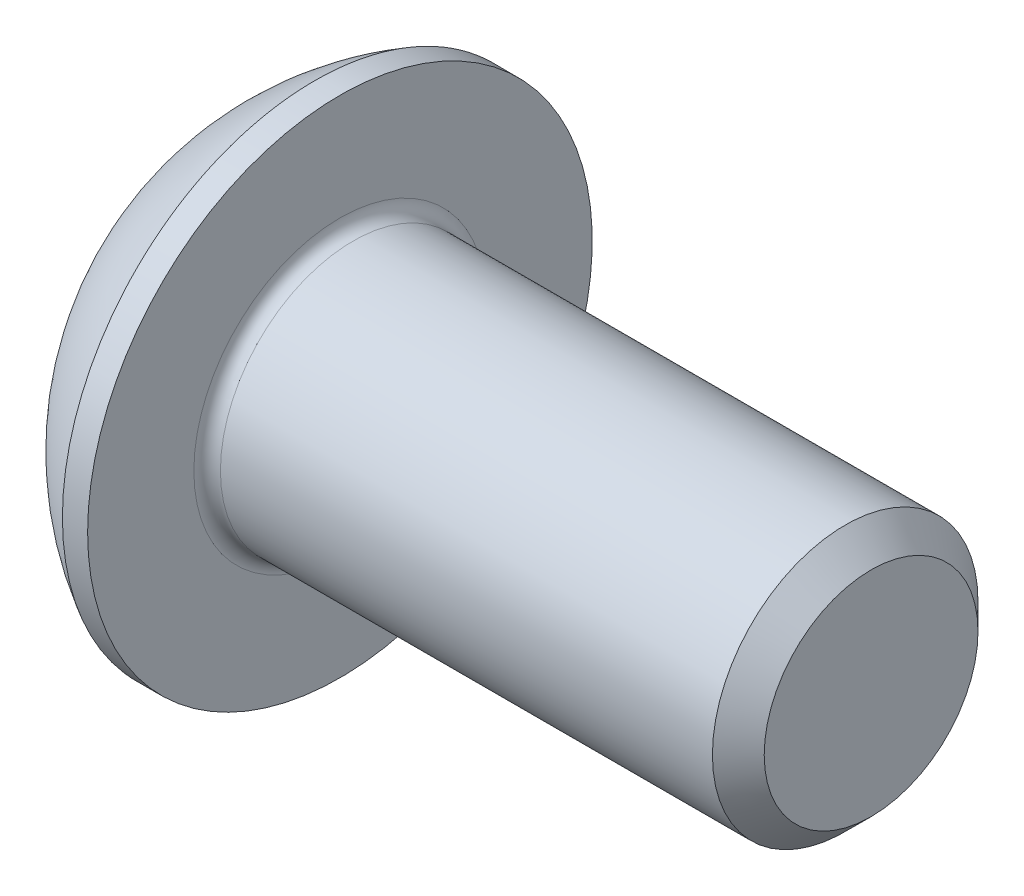
ISO-10303-21;
HEADER;
FILE_DESCRIPTION(('STEP AP214'),'2;1');
FILE_NAME('part.step','',(''),(''),'','','');
FILE_SCHEMA(('AUTOMOTIVE_DESIGN { 1 0 10303 214 1 1 1 1 }'));
ENDSEC;
DATA;
#1=APPLICATION_CONTEXT('core data for automotive mechanical design processes');
#2=APPLICATION_PROTOCOL_DEFINITION('international standard','automotive_design',2000,#1);
#3=PRODUCT_CONTEXT('',#1,'mechanical');
#4=PRODUCT('Part','Part','',(#3));
#5=PRODUCT_RELATED_PRODUCT_CATEGORY('part','',(#4));
#6=PRODUCT_DEFINITION_FORMATION('','',#4);
#7=PRODUCT_DEFINITION_CONTEXT('part definition',#1,'design');
#8=PRODUCT_DEFINITION('design','',#6,#7);
#9=PRODUCT_DEFINITION_SHAPE('','',#8);
#10=(LENGTH_UNIT() NAMED_UNIT(*) SI_UNIT(.MILLI.,.METRE.));
#11=(NAMED_UNIT(*) PLANE_ANGLE_UNIT() SI_UNIT($,.RADIAN.));
#12=(NAMED_UNIT(*) SI_UNIT($,.STERADIAN.) SOLID_ANGLE_UNIT());
#13=UNCERTAINTY_MEASURE_WITH_UNIT(LENGTH_MEASURE(1.E-05),#10,'distance_accuracy_value','');
#14=(GEOMETRIC_REPRESENTATION_CONTEXT(3) GLOBAL_UNCERTAINTY_ASSIGNED_CONTEXT((#13)) GLOBAL_UNIT_ASSIGNED_CONTEXT((#10,
#11,#12)) REPRESENTATION_CONTEXT('',''));
#15=CARTESIAN_POINT('',(0.,0.,0.));
#16=DIRECTION('',(0.,0.,1.));
#17=DIRECTION('',(1.,0.,0.));
#18=AXIS2_PLACEMENT_3D('',#15,#16,#17);
#19=CARTESIAN_POINT('',(1.29999999999997,0.,0.));
#20=DIRECTION('',(-1.,0.,0.));
#21=DIRECTION('',(0.,0.,1.));
#22=AXIS2_PLACEMENT_3D('',#19,#20,#21);
#23=CONICAL_SURFACE('',#22,1.24999999999997,1.04719755119663);
#24=CARTESIAN_POINT('',(2.02168783648693,0.,0.));
#25=VERTEX_POINT('',#24);
#26=VERTEX_LOOP('',#25);
#27=FACE_BOUND('',#26,.T.);
#28=CARTESIAN_POINT('',(1.29999999999997,0.,0.));
#29=DIRECTION('',(-1.,0.,0.));
#30=DIRECTION('',(0.,0.,1.));
#31=AXIS2_PLACEMENT_3D('',#28,#29,#30);
#32=CIRCLE('',#31,1.24999999999997);
#33=CARTESIAN_POINT('',(1.29999999999998,-1.08253175473054,0.624999999999992));
#34=VERTEX_POINT('',#33);
#35=CARTESIAN_POINT('',(1.29999999999998,0.,1.24999999999999));
#36=VERTEX_POINT('',#35);
#37=EDGE_CURVE('E97',#34,#36,#32,.T.);
#38=ORIENTED_EDGE('',*,*,#37,.T.);
#39=CARTESIAN_POINT('',(1.29999999999997,0.,0.));
#40=DIRECTION('',(-1.,0.,0.));
#41=DIRECTION('',(0.,0.,1.));
#42=AXIS2_PLACEMENT_3D('',#39,#40,#41);
#43=CIRCLE('',#42,1.24999999999997);
#44=CARTESIAN_POINT('',(1.29999999999998,1.08253175473054,0.624999999999992));
#45=VERTEX_POINT('',#44);
#46=EDGE_CURVE('E158',#36,#45,#43,.T.);
#47=ORIENTED_EDGE('',*,*,#46,.T.);
#48=CARTESIAN_POINT('',(1.29999999999997,0.,0.));
#49=DIRECTION('',(-1.,0.,0.));
#50=DIRECTION('',(0.,0.,1.));
#51=AXIS2_PLACEMENT_3D('',#48,#49,#50);
#52=CIRCLE('',#51,1.24999999999997);
#53=CARTESIAN_POINT('',(1.29999999999998,1.08253175473054,-0.624999999999994));
#54=VERTEX_POINT('',#53);
#55=EDGE_CURVE('E355',#45,#54,#52,.T.);
#56=ORIENTED_EDGE('',*,*,#55,.T.);
#57=CARTESIAN_POINT('',(1.29999999999997,0.,0.));
#58=DIRECTION('',(-1.,0.,0.));
#59=DIRECTION('',(0.,0.,1.));
#60=AXIS2_PLACEMENT_3D('',#57,#58,#59);
#61=CIRCLE('',#60,1.24999999999997);
#62=CARTESIAN_POINT('',(1.29999999999998,0.,-1.24999999999999));
#63=VERTEX_POINT('',#62);
#64=EDGE_CURVE('E356',#54,#63,#61,.T.);
#65=ORIENTED_EDGE('',*,*,#64,.T.);
#66=CARTESIAN_POINT('',(1.29999999999997,0.,0.));
#67=DIRECTION('',(-1.,0.,0.));
#68=DIRECTION('',(0.,0.,1.));
#69=AXIS2_PLACEMENT_3D('',#66,#67,#68);
#70=CIRCLE('',#69,1.24999999999997);
#71=CARTESIAN_POINT('',(1.29999999999998,-1.08253175473054,-0.624999999999993));
#72=VERTEX_POINT('',#71);
#73=EDGE_CURVE('E100',#63,#72,#70,.T.);
#74=ORIENTED_EDGE('',*,*,#73,.T.);
#75=CARTESIAN_POINT('',(1.29999999999997,0.,0.));
#76=DIRECTION('',(-1.,0.,0.));
#77=DIRECTION('',(0.,0.,1.));
#78=AXIS2_PLACEMENT_3D('',#75,#76,#77);
#79=CIRCLE('',#78,1.24999999999997);
#80=EDGE_CURVE('E95',#72,#34,#79,.T.);
#81=ORIENTED_EDGE('',*,*,#80,.T.);
#82=EDGE_LOOP('',(#38,#47,#56,#65,#74,#81));
#83=FACE_BOUND('',#82,.T.);
#84=ADVANCED_FACE('F16',(#27,#83),#23,.F.);
#85=CARTESIAN_POINT('',(1.3,-2.16506350946109,-1.25));
#86=DIRECTION('',(1.,0.,0.));
#87=DIRECTION('',(0.,0.,-1.));
#88=AXIS2_PLACEMENT_3D('',#85,#86,#87);
#89=PLANE('',#88);
#90=DIRECTION('',(0.,0.499999999999999,0.866025403784439));
#91=VECTOR('',#90,1.);
#92=CARTESIAN_POINT('',(1.3,-1.44337567297406,0.));
#93=LINE('',#92,#91);
#94=CARTESIAN_POINT('',(1.3,-0.721687836487032,1.25));
#95=VERTEX_POINT('',#94);
#96=EDGE_CURVE('E109',#95,#34,#93,.F.);
#97=ORIENTED_EDGE('',*,*,#96,.F.);
#98=DIRECTION('',(0.,1.,0.));
#99=VECTOR('',#98,1.);
#100=CARTESIAN_POINT('',(1.3,-0.721687836487032,1.25));
#101=LINE('',#100,#99);
#102=EDGE_CURVE('E111',#36,#95,#101,.F.);
#103=ORIENTED_EDGE('',*,*,#102,.F.);
#104=ORIENTED_EDGE('',*,*,#37,.F.);
#105=EDGE_LOOP('',(#97,#103,#104));
#106=FACE_BOUND('',#105,.T.);
#107=ADVANCED_FACE('F107',(#106),#89,.F.);
#108=CARTESIAN_POINT('',(1.3,-2.16506350946109,-1.25));
#109=DIRECTION('',(1.,0.,0.));
#110=DIRECTION('',(0.,0.,-1.));
#111=AXIS2_PLACEMENT_3D('',#108,#109,#110);
#112=PLANE('',#111);
#113=DIRECTION('',(0.,-0.499999999999999,0.866025403784439));
#114=VECTOR('',#113,1.);
#115=CARTESIAN_POINT('',(1.3,-0.721687836487033,-1.25));
#116=LINE('',#115,#114);
#117=CARTESIAN_POINT('',(1.3,-1.44337567297406,0.));
#118=VERTEX_POINT('',#117);
#119=EDGE_CURVE('E118',#118,#72,#116,.F.);
#120=ORIENTED_EDGE('',*,*,#119,.F.);
#121=DIRECTION('',(0.,0.499999999999999,0.866025403784439));
#122=VECTOR('',#121,1.);
#123=CARTESIAN_POINT('',(1.3,-1.44337567297406,0.));
#124=LINE('',#123,#122);
#125=EDGE_CURVE('E115',#34,#118,#124,.F.);
#126=ORIENTED_EDGE('',*,*,#125,.F.);
#127=ORIENTED_EDGE('',*,*,#80,.F.);
#128=EDGE_LOOP('',(#120,#126,#127));
#129=FACE_BOUND('',#128,.T.);
#130=ADVANCED_FACE('F116',(#129),#112,.F.);
#131=CARTESIAN_POINT('',(1.3,-2.16506350946109,-1.25));
#132=DIRECTION('',(1.,0.,0.));
#133=DIRECTION('',(0.,0.,-1.));
#134=AXIS2_PLACEMENT_3D('',#131,#132,#133);
#135=PLANE('',#134);
#136=DIRECTION('',(0.,1.,0.));
#137=VECTOR('',#136,1.);
#138=CARTESIAN_POINT('',(1.3,0.721687836487034,-1.25));
#139=LINE('',#138,#137);
#140=CARTESIAN_POINT('',(1.3,-0.721687836487033,-1.25));
#141=VERTEX_POINT('',#140);
#142=EDGE_CURVE('E324',#141,#63,#139,.T.);
#143=ORIENTED_EDGE('',*,*,#142,.F.);
#144=DIRECTION('',(0.,-0.499999999999999,0.866025403784439));
#145=VECTOR('',#144,1.);
#146=CARTESIAN_POINT('',(1.3,-0.721687836487033,-1.25));
#147=LINE('',#146,#145);
#148=EDGE_CURVE('E336',#72,#141,#147,.F.);
#149=ORIENTED_EDGE('',*,*,#148,.F.);
#150=ORIENTED_EDGE('',*,*,#73,.F.);
#151=EDGE_LOOP('',(#143,#149,#150));
#152=FACE_BOUND('',#151,.T.);
#153=ADVANCED_FACE('F202',(#152),#135,.F.);
#154=CARTESIAN_POINT('',(1.3,-2.16506350946109,-1.25));
#155=DIRECTION('',(1.,0.,0.));
#156=DIRECTION('',(0.,0.,-1.));
#157=AXIS2_PLACEMENT_3D('',#154,#155,#156);
#158=PLANE('',#157);
#159=DIRECTION('',(0.,-0.5,-0.866025403784439));
#160=VECTOR('',#159,1.);
#161=CARTESIAN_POINT('',(1.3,1.44337567297407,0.));
#162=LINE('',#161,#160);
#163=CARTESIAN_POINT('',(1.3,0.721687836487034,-1.25));
#164=VERTEX_POINT('',#163);
#165=EDGE_CURVE('E309',#164,#54,#162,.F.);
#166=ORIENTED_EDGE('',*,*,#165,.F.);
#167=DIRECTION('',(0.,1.,0.));
#168=VECTOR('',#167,1.);
#169=CARTESIAN_POINT('',(1.3,0.721687836487034,-1.25));
#170=LINE('',#169,#168);
#171=EDGE_CURVE('E321',#63,#164,#170,.T.);
#172=ORIENTED_EDGE('',*,*,#171,.F.);
#173=ORIENTED_EDGE('',*,*,#64,.F.);
#174=EDGE_LOOP('',(#166,#172,#173));
#175=FACE_BOUND('',#174,.T.);
#176=ADVANCED_FACE('F198',(#175),#158,.F.);
#177=CARTESIAN_POINT('',(1.3,-2.16506350946109,-1.25));
#178=DIRECTION('',(1.,0.,0.));
#179=DIRECTION('',(0.,0.,-1.));
#180=AXIS2_PLACEMENT_3D('',#177,#178,#179);
#181=PLANE('',#180);
#182=DIRECTION('',(0.,0.499999999999999,-0.866025403784439));
#183=VECTOR('',#182,1.);
#184=CARTESIAN_POINT('',(1.3,0.721687836487034,1.25));
#185=LINE('',#184,#183);
#186=CARTESIAN_POINT('',(1.3,1.44337567297407,0.));
#187=VERTEX_POINT('',#186);
#188=EDGE_CURVE('E287',#187,#45,#185,.F.);
#189=ORIENTED_EDGE('',*,*,#188,.F.);
#190=DIRECTION('',(0.,-0.5,-0.866025403784439));
#191=VECTOR('',#190,1.);
#192=CARTESIAN_POINT('',(1.3,1.44337567297407,0.));
#193=LINE('',#192,#191);
#194=EDGE_CURVE('E306',#54,#187,#193,.F.);
#195=ORIENTED_EDGE('',*,*,#194,.F.);
#196=ORIENTED_EDGE('',*,*,#55,.F.);
#197=EDGE_LOOP('',(#189,#195,#196));
#198=FACE_BOUND('',#197,.T.);
#199=ADVANCED_FACE('F194',(#198),#181,.F.);
#200=CARTESIAN_POINT('',(1.3,-2.16506350946109,-1.25));
#201=DIRECTION('',(1.,0.,0.));
#202=DIRECTION('',(0.,0.,-1.));
#203=AXIS2_PLACEMENT_3D('',#200,#201,#202);
#204=PLANE('',#203);
#205=DIRECTION('',(0.,1.,0.));
#206=VECTOR('',#205,1.);
#207=CARTESIAN_POINT('',(1.3,-0.721687836487032,1.25));
#208=LINE('',#207,#206);
#209=CARTESIAN_POINT('',(1.3,0.721687836487034,1.25));
#210=VERTEX_POINT('',#209);
#211=EDGE_CURVE('E127',#210,#36,#208,.F.);
#212=ORIENTED_EDGE('',*,*,#211,.F.);
#213=DIRECTION('',(0.,0.499999999999999,-0.866025403784439));
#214=VECTOR('',#213,1.);
#215=CARTESIAN_POINT('',(1.3,0.721687836487034,1.25));
#216=LINE('',#215,#214);
#217=EDGE_CURVE('E290',#45,#210,#216,.F.);
#218=ORIENTED_EDGE('',*,*,#217,.F.);
#219=ORIENTED_EDGE('',*,*,#46,.F.);
#220=EDGE_LOOP('',(#212,#218,#219));
#221=FACE_BOUND('',#220,.T.);
#222=ADVANCED_FACE('F190',(#221),#204,.F.);
#223=CARTESIAN_POINT('',(1.3,-0.721687836487032,1.25));
#224=DIRECTION('',(0.,0.,-1.));
#225=DIRECTION('',(0.,1.,0.));
#226=AXIS2_PLACEMENT_3D('',#223,#224,#225);
#227=PLANE('',#226);
#228=DIRECTION('',(0.,1.,0.));
#229=VECTOR('',#228,1.);
#230=CARTESIAN_POINT('',(0.,0.,1.25));
#231=LINE('',#230,#229);
#232=CARTESIAN_POINT('',(0.,0.721687836487034,1.25));
#233=VERTEX_POINT('',#232);
#234=CARTESIAN_POINT('',(0.,-0.721687836487032,1.25));
#235=VERTEX_POINT('',#234);
#236=EDGE_CURVE('E283',#233,#235,#231,.F.);
#237=ORIENTED_EDGE('',*,*,#236,.F.);
#238=DIRECTION('',(1.,0.,0.));
#239=VECTOR('',#238,1.);
#240=CARTESIAN_POINT('',(1.3,0.721687836487034,1.25));
#241=LINE('',#240,#239);
#242=EDGE_CURVE('E296',#210,#233,#241,.F.);
#243=ORIENTED_EDGE('',*,*,#242,.F.);
#244=ORIENTED_EDGE('',*,*,#211,.T.);
#245=ORIENTED_EDGE('',*,*,#102,.T.);
#246=DIRECTION('',(1.,0.,0.));
#247=VECTOR('',#246,1.);
#248=CARTESIAN_POINT('',(1.3,-0.721687836487032,1.25));
#249=LINE('',#248,#247);
#250=EDGE_CURVE('E121',#235,#95,#249,.T.);
#251=ORIENTED_EDGE('',*,*,#250,.F.);
#252=EDGE_LOOP('',(#237,#243,#244,#245,#251));
#253=FACE_BOUND('',#252,.T.);
#254=ADVANCED_FACE('F187',(#253),#227,.T.);
#255=CARTESIAN_POINT('',(1.3,-1.44337567297406,0.));
#256=DIRECTION('',(0.,0.866025403784439,-0.499999999999999));
#257=DIRECTION('',(0.,0.499999999999999,0.866025403784439));
#258=AXIS2_PLACEMENT_3D('',#255,#256,#257);
#259=PLANE('',#258);
#260=DIRECTION('',(0.,-0.499999999999999,-0.866025403784439));
#261=VECTOR('',#260,1.);
#262=CARTESIAN_POINT('',(0.,-0.721687836487032,1.25));
#263=LINE('',#262,#261);
#264=CARTESIAN_POINT('',(0.,-1.44337567297406,0.));
#265=VERTEX_POINT('',#264);
#266=EDGE_CURVE('E280',#235,#265,#263,.T.);
#267=ORIENTED_EDGE('',*,*,#266,.F.);
#268=ORIENTED_EDGE('',*,*,#250,.T.);
#269=ORIENTED_EDGE('',*,*,#96,.T.);
#270=ORIENTED_EDGE('',*,*,#125,.T.);
#271=DIRECTION('',(1.,0.,0.));
#272=VECTOR('',#271,1.);
#273=CARTESIAN_POINT('',(1.3,-1.44337567297406,0.));
#274=LINE('',#273,#272);
#275=EDGE_CURVE('E333',#265,#118,#274,.T.);
#276=ORIENTED_EDGE('',*,*,#275,.F.);
#277=EDGE_LOOP('',(#267,#268,#269,#270,#276));
#278=FACE_BOUND('',#277,.T.);
#279=ADVANCED_FACE('F125',(#278),#259,.T.);
#280=CARTESIAN_POINT('',(1.3,-0.721687836487033,-1.25));
#281=DIRECTION('',(0.,0.866025403784439,0.499999999999999));
#282=DIRECTION('',(0.,-0.499999999999999,0.866025403784439));
#283=AXIS2_PLACEMENT_3D('',#280,#281,#282);
#284=PLANE('',#283);
#285=DIRECTION('',(0.,0.499999999999999,-0.866025403784439));
#286=VECTOR('',#285,1.);
#287=CARTESIAN_POINT('',(0.,-1.44337567297406,0.));
#288=LINE('',#287,#286);
#289=CARTESIAN_POINT('',(0.,-0.721687836487033,-1.25));
#290=VERTEX_POINT('',#289);
#291=EDGE_CURVE('E277',#265,#290,#288,.T.);
#292=ORIENTED_EDGE('',*,*,#291,.F.);
#293=ORIENTED_EDGE('',*,*,#275,.T.);
#294=ORIENTED_EDGE('',*,*,#119,.T.);
#295=ORIENTED_EDGE('',*,*,#148,.T.);
#296=DIRECTION('',(1.,0.,0.));
#297=VECTOR('',#296,1.);
#298=CARTESIAN_POINT('',(1.3,-0.721687836487033,-1.25));
#299=LINE('',#298,#297);
#300=EDGE_CURVE('E318',#290,#141,#299,.T.);
#301=ORIENTED_EDGE('',*,*,#300,.F.);
#302=EDGE_LOOP('',(#292,#293,#294,#295,#301));
#303=FACE_BOUND('',#302,.T.);
#304=ADVANCED_FACE('F180',(#303),#284,.T.);
#305=CARTESIAN_POINT('',(1.3,0.721687836487034,-1.25));
#306=DIRECTION('',(0.,0.,1.));
#307=DIRECTION('',(1.,0.,0.));
#308=AXIS2_PLACEMENT_3D('',#305,#306,#307);
#309=PLANE('',#308);
#310=DIRECTION('',(0.,1.,0.));
#311=VECTOR('',#310,1.);
#312=CARTESIAN_POINT('',(0.,0.,-1.25));
#313=LINE('',#312,#311);
#314=CARTESIAN_POINT('',(0.,0.721687836487034,-1.25));
#315=VERTEX_POINT('',#314);
#316=EDGE_CURVE('E274',#290,#315,#313,.T.);
#317=ORIENTED_EDGE('',*,*,#316,.F.);
#318=ORIENTED_EDGE('',*,*,#300,.T.);
#319=ORIENTED_EDGE('',*,*,#142,.T.);
#320=ORIENTED_EDGE('',*,*,#171,.T.);
#321=DIRECTION('',(1.,0.,0.));
#322=VECTOR('',#321,1.);
#323=CARTESIAN_POINT('',(1.3,0.721687836487035,-1.25));
#324=LINE('',#323,#322);
#325=EDGE_CURVE('E291',#315,#164,#324,.T.);
#326=ORIENTED_EDGE('',*,*,#325,.F.);
#327=EDGE_LOOP('',(#317,#318,#319,#320,#326));
#328=FACE_BOUND('',#327,.T.);
#329=ADVANCED_FACE('F176',(#328),#309,.T.);
#330=CARTESIAN_POINT('',(1.3,1.44337567297407,0.));
#331=DIRECTION('',(0.,-0.866025403784439,0.5));
#332=DIRECTION('',(0.,-0.5,-0.866025403784439));
#333=AXIS2_PLACEMENT_3D('',#330,#331,#332);
#334=PLANE('',#333);
#335=DIRECTION('',(0.,0.5,0.866025403784439));
#336=VECTOR('',#335,1.);
#337=CARTESIAN_POINT('',(0.,0.721687836487034,-1.25));
#338=LINE('',#337,#336);
#339=CARTESIAN_POINT('',(0.,1.44337567297407,0.));
#340=VERTEX_POINT('',#339);
#341=EDGE_CURVE('E271',#315,#340,#338,.T.);
#342=ORIENTED_EDGE('',*,*,#341,.F.);
#343=ORIENTED_EDGE('',*,*,#325,.T.);
#344=ORIENTED_EDGE('',*,*,#165,.T.);
#345=ORIENTED_EDGE('',*,*,#194,.T.);
#346=DIRECTION('',(1.,0.,0.));
#347=VECTOR('',#346,1.);
#348=CARTESIAN_POINT('',(1.3,1.44337567297407,0.));
#349=LINE('',#348,#347);
#350=EDGE_CURVE('E286',#340,#187,#349,.T.);
#351=ORIENTED_EDGE('',*,*,#350,.F.);
#352=EDGE_LOOP('',(#342,#343,#344,#345,#351));
#353=FACE_BOUND('',#352,.T.);
#354=ADVANCED_FACE('F172',(#353),#334,.T.);
#355=CARTESIAN_POINT('',(1.3,0.721687836487034,1.25));
#356=DIRECTION('',(0.,-0.866025403784439,-0.499999999999999));
#357=DIRECTION('',(0.,0.499999999999999,-0.866025403784439));
#358=AXIS2_PLACEMENT_3D('',#355,#356,#357);
#359=PLANE('',#358);
#360=DIRECTION('',(0.,-0.499999999999999,0.866025403784439));
#361=VECTOR('',#360,1.);
#362=CARTESIAN_POINT('',(0.,1.44337567297407,0.));
#363=LINE('',#362,#361);
#364=EDGE_CURVE('E157',#340,#233,#363,.T.);
#365=ORIENTED_EDGE('',*,*,#364,.F.);
#366=ORIENTED_EDGE('',*,*,#350,.T.);
#367=ORIENTED_EDGE('',*,*,#188,.T.);
#368=ORIENTED_EDGE('',*,*,#217,.T.);
#369=ORIENTED_EDGE('',*,*,#242,.T.);
#370=EDGE_LOOP('',(#365,#366,#367,#368,#369));
#371=FACE_BOUND('',#370,.T.);
#372=ADVANCED_FACE('F168',(#371),#359,.T.);
#373=CARTESIAN_POINT('',(0.,0.,0.));
#374=DIRECTION('',(-1.,0.,0.));
#375=DIRECTION('',(0.,0.,1.));
#376=AXIS2_PLACEMENT_3D('',#373,#374,#375);
#377=PLANE('',#376);
#378=ORIENTED_EDGE('',*,*,#341,.T.);
#379=ORIENTED_EDGE('',*,*,#364,.T.);
#380=ORIENTED_EDGE('',*,*,#236,.T.);
#381=ORIENTED_EDGE('',*,*,#266,.T.);
#382=ORIENTED_EDGE('',*,*,#291,.T.);
#383=ORIENTED_EDGE('',*,*,#316,.T.);
#384=EDGE_LOOP('',(#378,#379,#380,#381,#382,#383));
#385=FACE_BOUND('',#384,.T.);
#386=CARTESIAN_POINT('',(0.,1.9,0.));
#387=CARTESIAN_POINT('',(0.,1.89999968010136,0.0533460417545378));
#388=CARTESIAN_POINT('',(0.,1.89775130588956,0.106701887672799));
#389=CARTESIAN_POINT('',(0.,1.88877243247591,0.213044855480449));
#390=CARTESIAN_POINT('',(0.,1.88204061001035,0.266031863842871));
#391=CARTESIAN_POINT('',(0.,1.86412510800511,0.371339625209729));
#392=CARTESIAN_POINT('',(-1.81098002099542E-13,1.85293436165001,0.423659183897682));
#393=CARTESIAN_POINT('',(1.8211298505609E-13,1.8261782214471,0.527198644134983));
#394=CARTESIAN_POINT('',(6.78867002881407E-13,1.81060927754463,0.578417616846782));
#395=CARTESIAN_POINT('',(1.12914284953613E-12,1.75755000759818,0.729655940597346));
#396=CARTESIAN_POINT('',(0.,1.71366366309715,0.827511217339642));
#397=CARTESIAN_POINT('',(0.,1.61006450881419,1.01445269093304));
#398=CARTESIAN_POINT('',(9.30981521463461E-13,1.55035109740115,1.10353855425762));
#399=CARTESIAN_POINT('',(5.8039442878546E-13,1.45026195521839,1.22865986644369));
#400=CARTESIAN_POINT('',(1.59201435745542E-13,1.41511930896794,1.26897262841384));
#401=CARTESIAN_POINT('',(-1.58180997978988E-13,1.34160247313475,1.34645946154778));
#402=CARTESIAN_POINT('',(0.,1.30323143191464,1.38363652140805));
#403=CARTESIAN_POINT('',(1.11018014677224E-13,1.18358246892881,1.49013889356964));
#404=CARTESIAN_POINT('',(0.,1.09774701475738,1.55446246269438));
#405=CARTESIAN_POINT('',(0.,0.916542032070723,1.66774790205048));
#406=CARTESIAN_POINT('',(0.,0.821172863236307,1.71671035152642));
#407=CARTESIAN_POINT('',(0.,0.623557468822231,1.79793817539276));
#408=CARTESIAN_POINT('',(0.,0.521311316705143,1.83020372811381));
#409=CARTESIAN_POINT('',(0.,0.312855691023037,1.87710869509009));
#410=CARTESIAN_POINT('',(0.,0.20664619629521,1.89174801521375));
#411=CARTESIAN_POINT('',(0.,-0.00672308255771565,1.90298922846909));
#412=CARTESIAN_POINT('',(0.,-0.113882866682815,1.89959112160076));
#413=CARTESIAN_POINT('',(0.,-0.326113132886848,1.87484970061209));
#414=CARTESIAN_POINT('',(0.,-0.431183626120375,1.85350648232594));
#415=CARTESIAN_POINT('',(0.,-0.636240213196767,1.79349315400563));
#416=CARTESIAN_POINT('',(0.,-0.736226252722186,1.75482285890884));
#417=CARTESIAN_POINT('',(0.,-0.928331791523706,1.66120502683467));
#418=CARTESIAN_POINT('',(0.,-1.02045099397542,1.60625687602522));
#419=CARTESIAN_POINT('',(0.,-1.15062853738865,1.51291644100122));
#420=CARTESIAN_POINT('',(0.,-1.19269361268679,1.47997710244794));
#421=CARTESIAN_POINT('',(0.,-1.27394554735879,1.41064415521453));
#422=CARTESIAN_POINT('',(0.,-1.31312958984223,1.37424724356267));
#423=CARTESIAN_POINT('',(0.,-1.42581201551345,1.26033565463976));
#424=CARTESIAN_POINT('',(0.,-1.49455573113341,1.17801746643294));
#425=CARTESIAN_POINT('',(0.,-1.61722461272475,1.00299676820987));
#426=CARTESIAN_POINT('',(0.,-1.67115034195071,0.910294653091355));
#427=CARTESIAN_POINT('',(0.,-1.73980754470837,0.765468877734463));
#428=CARTESIAN_POINT('',(0.,-1.76067223457078,0.716169385882707));
#429=CARTESIAN_POINT('',(0.,-1.79815986747464,0.616014564510612));
#430=CARTESIAN_POINT('',(0.,-1.81478624331854,0.565160531714833));
#431=CARTESIAN_POINT('',(0.,-1.8436679866937,0.46231825093578));
#432=CARTESIAN_POINT('',(0.,-1.85593025642402,0.410331933216881));
#433=CARTESIAN_POINT('',(0.,-1.87603361990682,0.305521142996555));
#434=CARTESIAN_POINT('',(0.,-1.88387601766849,0.252696922438153));
#435=CARTESIAN_POINT('',(0.,-1.89298507844157,0.166492357446634));
#436=CARTESIAN_POINT('',(0.,-1.8956148414719,0.133250032428581));
#437=CARTESIAN_POINT('',(0.,-1.89912240221099,0.0666730813081641));
#438=CARTESIAN_POINT('',(0.,-1.90000019991975,0.0333384552058006));
#439=CARTESIAN_POINT('',(0.,-1.89999968010137,-0.0533460417545387));
#440=CARTESIAN_POINT('',(0.,-1.89775130588958,-0.1067018876728));
#441=CARTESIAN_POINT('',(0.,-1.88877243247592,-0.21304485548045));
#442=CARTESIAN_POINT('',(0.,-1.88204061001036,-0.266031863842872));
#443=CARTESIAN_POINT('',(0.,-1.86412510800513,-0.371339625209729));
#444=CARTESIAN_POINT('',(-1.8150191335266E-13,-1.85293436165002,-0.423659183897682));
#445=CARTESIAN_POINT('',(1.82517224769069E-13,-1.82617822144711,-0.527198644134984));
#446=CARTESIAN_POINT('',(6.8035824482588E-13,-1.81060927754465,-0.578417616846782));
#447=CARTESIAN_POINT('',(1.13136337542742E-12,-1.7575500075982,-0.729655940597347));
#448=CARTESIAN_POINT('',(0.,-1.71366366309716,-0.827511217339641));
#449=CARTESIAN_POINT('',(0.,-1.61006450881421,-1.01445269093304));
#450=CARTESIAN_POINT('',(9.35809124084476E-13,-1.55035109740117,-1.10353855425762));
#451=CARTESIAN_POINT('',(5.83183908057228E-13,-1.45026195521841,-1.22865986644369));
#452=CARTESIAN_POINT('',(1.59923808202377E-13,-1.41511930896795,-1.26897262841383));
#453=CARTESIAN_POINT('',(-1.58902673959974E-13,-1.34160247313477,-1.34645946154778));
#454=CARTESIAN_POINT('',(0.,-1.30323143191466,-1.38363652140805));
#455=CARTESIAN_POINT('',(1.11220368554133E-13,-1.18358246892882,-1.49013889356964));
#456=CARTESIAN_POINT('',(0.,-1.0977470147574,-1.55446246269438));
#457=CARTESIAN_POINT('',(0.,-0.916542032070737,-1.66774790205048));
#458=CARTESIAN_POINT('',(0.,-0.821172863236323,-1.71671035152642));
#459=CARTESIAN_POINT('',(0.,-0.623557468822247,-1.79793817539276));
#460=CARTESIAN_POINT('',(0.,-0.521311316705158,-1.83020372811381));
#461=CARTESIAN_POINT('',(0.,-0.312855691023051,-1.87710869509009));
#462=CARTESIAN_POINT('',(0.,-0.206646196295225,-1.89174801521375));
#463=CARTESIAN_POINT('',(0.,0.0067230825577013,-1.90298922846909));
#464=CARTESIAN_POINT('',(0.,0.113882866682801,-1.89959112160076));
#465=CARTESIAN_POINT('',(0.,0.326113132886833,-1.87484970061209));
#466=CARTESIAN_POINT('',(0.,0.43118362612036,-1.85350648232594));
#467=CARTESIAN_POINT('',(0.,0.636240213196753,-1.79349315400564));
#468=CARTESIAN_POINT('',(0.,0.736226252722172,-1.75482285890884));
#469=CARTESIAN_POINT('',(0.,0.928331791523691,-1.66120502683468));
#470=CARTESIAN_POINT('',(0.,1.0204509939754,-1.60625687602522));
#471=CARTESIAN_POINT('',(0.,1.15062853738863,-1.51291644100122));
#472=CARTESIAN_POINT('',(0.,1.19269361268677,-1.47997710244794));
#473=CARTESIAN_POINT('',(0.,1.27394554735877,-1.41064415521453));
#474=CARTESIAN_POINT('',(0.,1.31312958984222,-1.37424724356267));
#475=CARTESIAN_POINT('',(0.,1.42581201551343,-1.26033565463976));
#476=CARTESIAN_POINT('',(0.,1.4945557311334,-1.17801746643294));
#477=CARTESIAN_POINT('',(0.,1.61722461272473,-1.00299676820986));
#478=CARTESIAN_POINT('',(0.,1.67115034195069,-0.910294653091354));
#479=CARTESIAN_POINT('',(0.,1.73980754470835,-0.765468877734463));
#480=CARTESIAN_POINT('',(0.,1.76067223457077,-0.716169385882708));
#481=CARTESIAN_POINT('',(0.,1.79815986747463,-0.616014564510613));
#482=CARTESIAN_POINT('',(0.,1.81478624331853,-0.565160531714832));
#483=CARTESIAN_POINT('',(0.,1.84366798669369,-0.462318250935779));
#484=CARTESIAN_POINT('',(0.,1.855930256424,-0.410331933216881));
#485=CARTESIAN_POINT('',(0.,1.87603361990681,-0.305521142996556));
#486=CARTESIAN_POINT('',(0.,1.88387601766848,-0.252696922438154));
#487=CARTESIAN_POINT('',(0.,1.89298507844156,-0.166492357446635));
#488=CARTESIAN_POINT('',(0.,1.89561484147189,-0.133250032428582));
#489=CARTESIAN_POINT('',(0.,1.89912240221097,-0.0666730813081651));
#490=CARTESIAN_POINT('',(0.,1.90000019991973,-0.0333384552058015));
#491=CARTESIAN_POINT('',(0.,1.9,0.));
#492=B_SPLINE_CURVE_WITH_KNOTS('',3,(#386,#387,#388,#389,#390,#391,#392,#393,#394,#395,#396,
#397,#398,#399,#400,#401,#402,#403,#404,#405,#406,#407,#408,#409,#410,#411,#412,#413,#414,#415,
#416,#417,#418,#419,#420,#421,#422,#423,#424,#425,#426,#427,#428,#429,#430,#431,#432,#433,#434,
#435,#436,#437,#438,#439,#440,#441,#442,#443,#444,#445,#446,#447,#448,#449,#450,#451,#452,#453,
#454,#455,#456,#457,#458,#459,#460,#461,#462,#463,#464,#465,#466,#467,#468,#469,#470,#471,#472,
#473,#474,#475,#476,#477,#478,#479,#480,#481,#482,#483,#484,#485,#486,#487,#488,#489,#490,#491),
.UNSPECIFIED.,.T.,.F.,(4,2,2,2,2,2,2,2,2,2,2,2,2,2,2,2,2,2,2,2,2,2,2,2,2,2,2,2,2,2,2,2,2,2,2,2,
2,2,2,2,2,2,2,2,2,2,2,2,2,2,2,2,4),(0.,0.160007433583116,0.320062113371229,0.480371474509696,
0.640811198915063,0.960925850514503,1.28105267231364,1.44132582607845,1.60144445238343,
1.92157897188696,2.24170141815079,2.56182044528683,2.88194118198678,3.20206191868677,
3.52218094582286,3.84230339208664,4.1624379115897,4.32255653789448,4.48282969165911,
4.80295651345848,5.12307116505822,5.28351088946383,5.44382025060249,5.6038749303907,
5.76388236397395,5.86387854891398,5.96387473385402,6.12388216743714,6.28393684722525,
6.44424620836372,6.60468593276908,6.92480058436852,7.24492740616767,7.40520055993247,
7.56531918623745,7.88545370574099,8.20557615200481,8.52569517914086,8.84581591584081,
9.16593665254079,9.48605567967688,9.80617812594066,10.1263126454437,10.2864312717485,
10.4467044255131,10.7668312473125,11.0869458989122,11.2473856233178,11.4076949844565,
11.5677496642447,11.727757097828,11.827753282768,11.927749467708),.UNSPECIFIED.);
#493=CARTESIAN_POINT('',(0.,1.9,0.));
#494=VERTEX_POINT('',#493);
#495=EDGE_CURVE('E150',#494,#494,#492,.T.);
#496=ORIENTED_EDGE('',*,*,#495,.F.);
#497=EDGE_LOOP('',(#496));
#498=FACE_BOUND('',#497,.T.);
#499=ADVANCED_FACE('F164',(#385,#498),#377,.T.);
#500=CARTESIAN_POINT('',(3.88527472527473,0.,0.));
#501=DIRECTION('',(0.,1.,0.));
#502=DIRECTION('',(1.,0.,0.));
#503=AXIS2_PLACEMENT_3D('',#500,#501,#502);
#504=SPHERICAL_SURFACE('',#503,4.32496932831421);
#505=CARTESIAN_POINT('',(1.82,0.,0.));
#506=DIRECTION('',(-1.,0.,0.));
#507=DIRECTION('',(0.,0.,1.));
#508=AXIS2_PLACEMENT_3D('',#505,#506,#507);
#509=CIRCLE('',#508,3.8);
#510=CARTESIAN_POINT('',(1.82,0.,3.8));
#511=VERTEX_POINT('',#510);
#512=EDGE_CURVE('E147',#511,#511,#509,.F.);
#513=ORIENTED_EDGE('',*,*,#512,.F.);
#514=EDGE_LOOP('',(#513));
#515=FACE_BOUND('',#514,.T.);
#516=ORIENTED_EDGE('',*,*,#495,.T.);
#517=EDGE_LOOP('',(#516));
#518=FACE_BOUND('',#517,.T.);
#519=ADVANCED_FACE('F160',(#515,#518),#504,.T.);
#520=CARTESIAN_POINT('',(0.,0.,0.));
#521=DIRECTION('',(-1.,0.,0.));
#522=DIRECTION('',(0.,0.,1.));
#523=AXIS2_PLACEMENT_3D('',#520,#521,#522);
#524=CYLINDRICAL_SURFACE('',#523,3.8);
#525=ORIENTED_EDGE('',*,*,#512,.T.);
#526=EDGE_LOOP('',(#525));
#527=FACE_BOUND('',#526,.T.);
#528=CARTESIAN_POINT('',(2.2,0.,0.));
#529=DIRECTION('',(-1.,0.,0.));
#530=DIRECTION('',(0.,0.,1.));
#531=AXIS2_PLACEMENT_3D('',#528,#529,#530);
#532=CIRCLE('',#531,3.8);
#533=CARTESIAN_POINT('',(2.2,0.,3.8));
#534=VERTEX_POINT('',#533);
#535=EDGE_CURVE('E144',#534,#534,#532,.T.);
#536=ORIENTED_EDGE('',*,*,#535,.T.);
#537=EDGE_LOOP('',(#536));
#538=FACE_BOUND('',#537,.T.);
#539=ADVANCED_FACE('F369',(#527,#538),#524,.T.);
#540=CARTESIAN_POINT('',(10.2,0.,0.));
#541=DIRECTION('',(-1.,0.,0.));
#542=DIRECTION('',(0.,0.,1.));
#543=AXIS2_PLACEMENT_3D('',#540,#541,#542);
#544=PLANE('',#543);
#545=CARTESIAN_POINT('',(10.2000000000544,0.,0.));
#546=DIRECTION('',(-1.,0.,0.));
#547=DIRECTION('',(0.,0.,1.));
#548=AXIS2_PLACEMENT_3D('',#545,#546,#547);
#549=CIRCLE('',#548,1.60999999997102);
#550=CARTESIAN_POINT('',(10.2000000000544,0.,1.60999999997102));
#551=VERTEX_POINT('',#550);
#552=EDGE_CURVE('E140',#551,#551,#549,.T.);
#553=ORIENTED_EDGE('',*,*,#552,.F.);
#554=EDGE_LOOP('',(#553));
#555=FACE_BOUND('',#554,.T.);
#556=ADVANCED_FACE('F247',(#555),#544,.F.);
#557=CARTESIAN_POINT('',(2.2,1.99999999999999,0.));
#558=DIRECTION('',(-1.,0.,0.));
#559=DIRECTION('',(0.,0.,1.));
#560=AXIS2_PLACEMENT_3D('',#557,#558,#559);
#561=PLANE('',#560);
#562=ORIENTED_EDGE('',*,*,#535,.F.);
#563=EDGE_LOOP('',(#562));
#564=FACE_BOUND('',#563,.T.);
#565=CARTESIAN_POINT('',(2.2,0.,0.));
#566=DIRECTION('',(1.,0.,0.));
#567=DIRECTION('',(0.,0.,1.));
#568=AXIS2_PLACEMENT_3D('',#565,#566,#567);
#569=CIRCLE('',#568,2.19999999999999);
#570=CARTESIAN_POINT('',(2.2,0.,-2.19999999999999));
#571=VERTEX_POINT('',#570);
#572=CARTESIAN_POINT('',(2.2,0.,2.19999999999999));
#573=VERTEX_POINT('',#572);
#574=EDGE_CURVE('E143',#571,#573,#569,.F.);
#575=ORIENTED_EDGE('',*,*,#574,.T.);
#576=CARTESIAN_POINT('',(2.2,0.,0.));
#577=DIRECTION('',(1.,0.,0.));
#578=DIRECTION('',(0.,0.,-1.));
#579=AXIS2_PLACEMENT_3D('',#576,#577,#578);
#580=CIRCLE('',#579,2.19999999999999);
#581=EDGE_CURVE('E35',#573,#571,#580,.F.);
#582=ORIENTED_EDGE('',*,*,#581,.T.);
#583=EDGE_LOOP('',(#575,#582));
#584=FACE_BOUND('',#583,.T.);
#585=ADVANCED_FACE('F238',(#564,#584),#561,.F.);
#586=CARTESIAN_POINT('',(9.81000000001586,0.,0.));
#587=DIRECTION('',(-1.,0.,0.));
#588=DIRECTION('',(0.,0.,1.));
#589=AXIS2_PLACEMENT_3D('',#586,#587,#588);
#590=CONICAL_SURFACE('',#589,2.00000000000955,0.785398163397448);
#591=CARTESIAN_POINT('',(9.81000000000003,0.,0.));
#592=DIRECTION('',(-1.,0.,0.));
#593=DIRECTION('',(0.,0.,1.));
#594=AXIS2_PLACEMENT_3D('',#591,#592,#593);
#595=CIRCLE('',#594,1.99999999999999);
#596=CARTESIAN_POINT('',(9.81000000000003,0.,1.99999999999999));
#597=VERTEX_POINT('',#596);
#598=EDGE_CURVE('E27',#597,#597,#595,.T.);
#599=ORIENTED_EDGE('',*,*,#598,.F.);
#600=EDGE_LOOP('',(#599));
#601=FACE_BOUND('',#600,.T.);
#602=ORIENTED_EDGE('',*,*,#552,.T.);
#603=EDGE_LOOP('',(#602));
#604=FACE_BOUND('',#603,.T.);
#605=ADVANCED_FACE('F222',(#601,#604),#590,.T.);
#606=CARTESIAN_POINT('',(2.4,0.,0.));
#607=DIRECTION('',(-1.,0.,0.));
#608=DIRECTION('',(0.,0.,1.));
#609=AXIS2_PLACEMENT_3D('',#606,#607,#608);
#610=TOROIDAL_SURFACE('',#609,2.19999999999999,0.2);
#611=ORIENTED_EDGE('',*,*,#581,.F.);
#612=ORIENTED_EDGE('',*,*,#574,.F.);
#613=EDGE_LOOP('',(#611,#612));
#614=FACE_BOUND('',#613,.T.);
#615=CARTESIAN_POINT('',(2.4,0.,0.));
#616=DIRECTION('',(-1.,0.,0.));
#617=DIRECTION('',(0.,0.,1.));
#618=AXIS2_PLACEMENT_3D('',#615,#616,#617);
#619=CIRCLE('',#618,1.99999999999999);
#620=CARTESIAN_POINT('',(2.4,0.,1.99999999999999));
#621=VERTEX_POINT('',#620);
#622=EDGE_CURVE('E11',#621,#621,#619,.F.);
#623=ORIENTED_EDGE('',*,*,#622,.F.);
#624=EDGE_LOOP('',(#623));
#625=FACE_BOUND('',#624,.T.);
#626=ADVANCED_FACE('F216',(#614,#625),#610,.F.);
#627=CARTESIAN_POINT('',(0.,0.,0.));
#628=DIRECTION('',(-1.,0.,0.));
#629=DIRECTION('',(0.,0.,1.));
#630=AXIS2_PLACEMENT_3D('',#627,#628,#629);
#631=CYLINDRICAL_SURFACE('',#630,1.99999999999999);
#632=ORIENTED_EDGE('',*,*,#622,.T.);
#633=EDGE_LOOP('',(#632));
#634=FACE_BOUND('',#633,.T.);
#635=ORIENTED_EDGE('',*,*,#598,.T.);
#636=EDGE_LOOP('',(#635));
#637=FACE_BOUND('',#636,.T.);
#638=ADVANCED_FACE('F214',(#634,#637),#631,.T.);
#639=CLOSED_SHELL('',(#84,#107,#130,#153,#176,#199,#222,#254,#279,#304,#329,#354,#372,#499,#519,
#539,#556,#585,#605,#626,#638));
#640=MANIFOLD_SOLID_BREP('B1',#639);
#641=ADVANCED_BREP_SHAPE_REPRESENTATION('',(#18,#640),#14);
#642=SHAPE_DEFINITION_REPRESENTATION(#9,#641);
ENDSEC;
END-ISO-10303-21;
